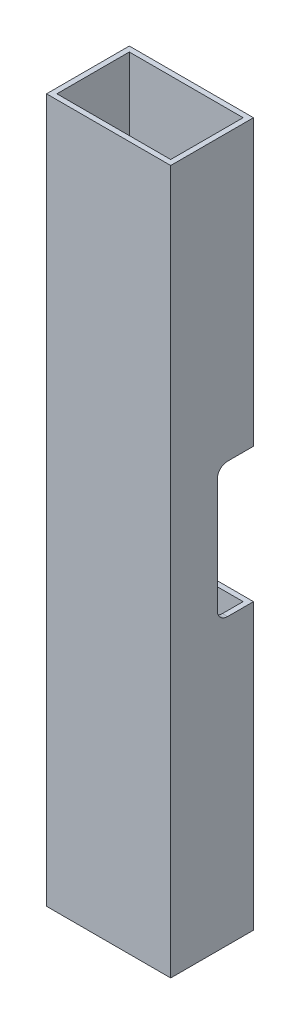
ISO-10303-21;
HEADER;
FILE_DESCRIPTION(('STEP AP214'),'2;1');
FILE_NAME('part.step','',(''),(''),'','','');
FILE_SCHEMA(('AUTOMOTIVE_DESIGN { 1 0 10303 214 1 1 1 1 }'));
ENDSEC;
DATA;
#1=APPLICATION_CONTEXT('core data for automotive mechanical design processes');
#2=APPLICATION_PROTOCOL_DEFINITION('international standard','automotive_design',2000,#1);
#3=PRODUCT_CONTEXT('',#1,'mechanical');
#4=PRODUCT('Part','Part','',(#3));
#5=PRODUCT_RELATED_PRODUCT_CATEGORY('part','',(#4));
#6=PRODUCT_DEFINITION_FORMATION('','',#4);
#7=PRODUCT_DEFINITION_CONTEXT('part definition',#1,'design');
#8=PRODUCT_DEFINITION('design','',#6,#7);
#9=PRODUCT_DEFINITION_SHAPE('','',#8);
#10=(LENGTH_UNIT() NAMED_UNIT(*) SI_UNIT(.MILLI.,.METRE.));
#11=(NAMED_UNIT(*) PLANE_ANGLE_UNIT() SI_UNIT($,.RADIAN.));
#12=(NAMED_UNIT(*) SI_UNIT($,.STERADIAN.) SOLID_ANGLE_UNIT());
#13=UNCERTAINTY_MEASURE_WITH_UNIT(LENGTH_MEASURE(1.E-05),#10,'distance_accuracy_value','');
#14=(GEOMETRIC_REPRESENTATION_CONTEXT(3) GLOBAL_UNCERTAINTY_ASSIGNED_CONTEXT((#13)) GLOBAL_UNIT_ASSIGNED_CONTEXT((#10,
#11,#12)) REPRESENTATION_CONTEXT('',''));
#15=CARTESIAN_POINT('',(0.,0.,0.));
#16=DIRECTION('',(0.,0.,1.));
#17=DIRECTION('',(1.,0.,0.));
#18=AXIS2_PLACEMENT_3D('',#15,#16,#17);
#19=CARTESIAN_POINT('',(0.,-215.9,-25.4));
#20=DIRECTION('',(0.,0.,-1.));
#21=DIRECTION('',(-1.,0.,0.));
#22=AXIS2_PLACEMENT_3D('',#19,#20,#21);
#23=PLANE('',#22);
#24=DIRECTION('',(0.,1.,0.));
#25=VECTOR('',#24,1.);
#26=CARTESIAN_POINT('',(38.1,-215.9,-25.4));
#27=LINE('',#26,#25);
#28=CARTESIAN_POINT('',(38.1,41.275,-25.4));
#29=VERTEX_POINT('',#28);
#30=CARTESIAN_POINT('',(38.1,215.9,-25.4));
#31=VERTEX_POINT('',#30);
#32=EDGE_CURVE('E215',#29,#31,#27,.T.);
#33=ORIENTED_EDGE('',*,*,#32,.F.);
#34=DIRECTION('',(-1.,0.,0.));
#35=VECTOR('',#34,1.);
#36=CARTESIAN_POINT('',(1971.59584113364,41.275,-25.3999999999995));
#37=LINE('',#36,#35);
#38=CARTESIAN_POINT('',(-38.1,41.275,-25.4));
#39=VERTEX_POINT('',#38);
#40=EDGE_CURVE('E202',#29,#39,#37,.T.);
#41=ORIENTED_EDGE('',*,*,#40,.T.);
#42=DIRECTION('',(0.,1.,0.));
#43=VECTOR('',#42,1.);
#44=CARTESIAN_POINT('',(-38.1,-215.9,-25.4));
#45=LINE('',#44,#43);
#46=CARTESIAN_POINT('',(-38.1,215.9,-25.4));
#47=VERTEX_POINT('',#46);
#48=EDGE_CURVE('E213',#39,#47,#45,.T.);
#49=ORIENTED_EDGE('',*,*,#48,.T.);
#50=DIRECTION('',(-1.,0.,0.));
#51=VECTOR('',#50,1.);
#52=CARTESIAN_POINT('',(0.,215.9,-25.4));
#53=LINE('',#52,#51);
#54=EDGE_CURVE('E329',#31,#47,#53,.T.);
#55=ORIENTED_EDGE('',*,*,#54,.F.);
#56=EDGE_LOOP('',(#33,#41,#49,#55));
#57=FACE_BOUND('',#56,.T.);
#58=ADVANCED_FACE('F16',(#57),#23,.T.);
#59=CARTESIAN_POINT('',(34.925,-215.9,0.));
#60=DIRECTION('',(1.,0.,0.));
#61=DIRECTION('',(0.,0.,-1.));
#62=AXIS2_PLACEMENT_3D('',#59,#60,#61);
#63=PLANE('',#62);
#64=DIRECTION('',(0.,0.,-1.));
#65=VECTOR('',#64,1.);
#66=CARTESIAN_POINT('',(34.925,41.275,-1.29116165991135E-13));
#67=LINE('',#66,#65);
#68=CARTESIAN_POINT('',(34.925,41.275,-9.525));
#69=VERTEX_POINT('',#68);
#70=CARTESIAN_POINT('',(34.925,41.275,-22.225));
#71=VERTEX_POINT('',#70);
#72=EDGE_CURVE('E700',#69,#71,#67,.T.);
#73=ORIENTED_EDGE('',*,*,#72,.F.);
#74=CARTESIAN_POINT('',(34.925,34.925,-9.525));
#75=DIRECTION('',(1.,0.,0.));
#76=DIRECTION('',(0.,0.,-1.));
#77=AXIS2_PLACEMENT_3D('',#74,#75,#76);
#78=CIRCLE('',#77,6.35);
#79=CARTESIAN_POINT('',(34.925,34.925,-3.175));
#80=VERTEX_POINT('',#79);
#81=EDGE_CURVE('E595',#69,#80,#78,.T.);
#82=ORIENTED_EDGE('',*,*,#81,.T.);
#83=DIRECTION('',(0.,-1.,0.));
#84=VECTOR('',#83,1.);
#85=CARTESIAN_POINT('',(34.925,-215.9,-3.17499999999996));
#86=LINE('',#85,#84);
#87=CARTESIAN_POINT('',(34.925,-34.925,-3.175));
#88=VERTEX_POINT('',#87);
#89=EDGE_CURVE('E590',#80,#88,#86,.T.);
#90=ORIENTED_EDGE('',*,*,#89,.T.);
#91=CARTESIAN_POINT('',(34.925,-34.925,-9.525));
#92=DIRECTION('',(1.,0.,0.));
#93=DIRECTION('',(0.,0.,-1.));
#94=AXIS2_PLACEMENT_3D('',#91,#92,#93);
#95=CIRCLE('',#94,6.35);
#96=CARTESIAN_POINT('',(34.925,-41.275,-9.525));
#97=VERTEX_POINT('',#96);
#98=EDGE_CURVE('E281',#88,#97,#95,.T.);
#99=ORIENTED_EDGE('',*,*,#98,.T.);
#100=DIRECTION('',(0.,0.,-1.));
#101=VECTOR('',#100,1.);
#102=CARTESIAN_POINT('',(34.925,-41.275,0.));
#103=LINE('',#102,#101);
#104=CARTESIAN_POINT('',(34.925,-41.275,-22.225));
#105=VERTEX_POINT('',#104);
#106=EDGE_CURVE('E280',#97,#105,#103,.T.);
#107=ORIENTED_EDGE('',*,*,#106,.T.);
#108=DIRECTION('',(0.,1.,0.));
#109=VECTOR('',#108,1.);
#110=CARTESIAN_POINT('',(34.925,-215.9,-22.225));
#111=LINE('',#110,#109);
#112=CARTESIAN_POINT('',(34.925,-215.9,-22.225));
#113=VERTEX_POINT('',#112);
#114=EDGE_CURVE('E278',#113,#105,#111,.T.);
#115=ORIENTED_EDGE('',*,*,#114,.F.);
#116=DIRECTION('',(0.,0.,-1.));
#117=VECTOR('',#116,1.);
#118=CARTESIAN_POINT('',(34.925,-215.9,0.));
#119=LINE('',#118,#117);
#120=CARTESIAN_POINT('',(34.925,-215.9,22.225));
#121=VERTEX_POINT('',#120);
#122=EDGE_CURVE('E311',#121,#113,#119,.T.);
#123=ORIENTED_EDGE('',*,*,#122,.F.);
#124=DIRECTION('',(0.,1.,0.));
#125=VECTOR('',#124,1.);
#126=CARTESIAN_POINT('',(34.925,-215.9,22.225));
#127=LINE('',#126,#125);
#128=CARTESIAN_POINT('',(34.925,215.9,22.225));
#129=VERTEX_POINT('',#128);
#130=EDGE_CURVE('E250',#121,#129,#127,.T.);
#131=ORIENTED_EDGE('',*,*,#130,.T.);
#132=DIRECTION('',(0.,0.,-1.));
#133=VECTOR('',#132,1.);
#134=CARTESIAN_POINT('',(34.925,215.9,0.));
#135=LINE('',#134,#133);
#136=CARTESIAN_POINT('',(34.925,215.9,-22.225));
#137=VERTEX_POINT('',#136);
#138=EDGE_CURVE('E309',#129,#137,#135,.T.);
#139=ORIENTED_EDGE('',*,*,#138,.T.);
#140=EDGE_CURVE('E288',#71,#137,#111,.T.);
#141=ORIENTED_EDGE('',*,*,#140,.F.);
#142=EDGE_LOOP('',(#73,#82,#90,#99,#107,#115,#123,#131,#139,#141));
#143=FACE_BOUND('',#142,.T.);
#144=ADVANCED_FACE('F307',(#143),#63,.F.);
#145=CARTESIAN_POINT('',(0.,-215.9,-22.225));
#146=DIRECTION('',(0.,0.,-1.));
#147=DIRECTION('',(-1.,0.,0.));
#148=AXIS2_PLACEMENT_3D('',#145,#146,#147);
#149=PLANE('',#148);
#150=DIRECTION('',(-1.,0.,0.));
#151=VECTOR('',#150,1.);
#152=CARTESIAN_POINT('',(0.,41.275,-22.225));
#153=LINE('',#152,#151);
#154=CARTESIAN_POINT('',(-34.925,41.275,-22.225));
#155=VERTEX_POINT('',#154);
#156=EDGE_CURVE('E692',#71,#155,#153,.T.);
#157=ORIENTED_EDGE('',*,*,#156,.F.);
#158=ORIENTED_EDGE('',*,*,#140,.T.);
#159=DIRECTION('',(-1.,0.,0.));
#160=VECTOR('',#159,1.);
#161=CARTESIAN_POINT('',(0.,215.9,-22.225));
#162=LINE('',#161,#160);
#163=CARTESIAN_POINT('',(-34.925,215.9,-22.225));
#164=VERTEX_POINT('',#163);
#165=EDGE_CURVE('E324',#137,#164,#162,.T.);
#166=ORIENTED_EDGE('',*,*,#165,.T.);
#167=DIRECTION('',(0.,1.,0.));
#168=VECTOR('',#167,1.);
#169=CARTESIAN_POINT('',(-34.925,-215.9,-22.225));
#170=LINE('',#169,#168);
#171=EDGE_CURVE('E289',#155,#164,#170,.T.);
#172=ORIENTED_EDGE('',*,*,#171,.F.);
#173=EDGE_LOOP('',(#157,#158,#166,#172));
#174=FACE_BOUND('',#173,.T.);
#175=ADVANCED_FACE('F482',(#174),#149,.F.);
#176=CARTESIAN_POINT('',(38.1,-215.9,0.));
#177=DIRECTION('',(1.,0.,0.));
#178=DIRECTION('',(0.,0.,-1.));
#179=AXIS2_PLACEMENT_3D('',#176,#177,#178);
#180=PLANE('',#179);
#181=CARTESIAN_POINT('',(38.1,34.925,-9.525));
#182=DIRECTION('',(1.,0.,0.));
#183=DIRECTION('',(0.,0.,-1.));
#184=AXIS2_PLACEMENT_3D('',#181,#182,#183);
#185=CIRCLE('',#184,6.35);
#186=CARTESIAN_POINT('',(38.1,41.275,-9.525));
#187=VERTEX_POINT('',#186);
#188=CARTESIAN_POINT('',(38.1,34.925,-3.175));
#189=VERTEX_POINT('',#188);
#190=EDGE_CURVE('E217',#187,#189,#185,.T.);
#191=ORIENTED_EDGE('',*,*,#190,.F.);
#192=DIRECTION('',(0.,0.,-1.));
#193=VECTOR('',#192,1.);
#194=CARTESIAN_POINT('',(38.1,41.275,-1.29116165991135E-13));
#195=LINE('',#194,#193);
#196=EDGE_CURVE('E357',#187,#29,#195,.T.);
#197=ORIENTED_EDGE('',*,*,#196,.T.);
#198=ORIENTED_EDGE('',*,*,#32,.T.);
#199=DIRECTION('',(0.,0.,-1.));
#200=VECTOR('',#199,1.);
#201=CARTESIAN_POINT('',(38.1,215.9,0.));
#202=LINE('',#201,#200);
#203=CARTESIAN_POINT('',(38.1,215.9,25.4));
#204=VERTEX_POINT('',#203);
#205=EDGE_CURVE('E376',#204,#31,#202,.T.);
#206=ORIENTED_EDGE('',*,*,#205,.F.);
#207=DIRECTION('',(0.,1.,0.));
#208=VECTOR('',#207,1.);
#209=CARTESIAN_POINT('',(38.1,-215.9,25.4));
#210=LINE('',#209,#208);
#211=CARTESIAN_POINT('',(38.1,-215.9,25.4));
#212=VERTEX_POINT('',#211);
#213=EDGE_CURVE('E242',#212,#204,#210,.T.);
#214=ORIENTED_EDGE('',*,*,#213,.F.);
#215=DIRECTION('',(0.,0.,-1.));
#216=VECTOR('',#215,1.);
#217=CARTESIAN_POINT('',(38.1,-215.9,0.));
#218=LINE('',#217,#216);
#219=CARTESIAN_POINT('',(38.1,-215.9,-25.4));
#220=VERTEX_POINT('',#219);
#221=EDGE_CURVE('E342',#212,#220,#218,.T.);
#222=ORIENTED_EDGE('',*,*,#221,.T.);
#223=CARTESIAN_POINT('',(38.1,-41.275,-25.4));
#224=VERTEX_POINT('',#223);
#225=EDGE_CURVE('E227',#220,#224,#27,.T.);
#226=ORIENTED_EDGE('',*,*,#225,.T.);
#227=DIRECTION('',(0.,0.,-1.));
#228=VECTOR('',#227,1.);
#229=CARTESIAN_POINT('',(38.1,-41.275,0.));
#230=LINE('',#229,#228);
#231=CARTESIAN_POINT('',(38.1,-41.275,-9.525));
#232=VERTEX_POINT('',#231);
#233=EDGE_CURVE('E689',#232,#224,#230,.T.);
#234=ORIENTED_EDGE('',*,*,#233,.F.);
#235=CARTESIAN_POINT('',(38.1,-34.925,-9.525));
#236=DIRECTION('',(1.,0.,0.));
#237=DIRECTION('',(0.,0.,-1.));
#238=AXIS2_PLACEMENT_3D('',#235,#236,#237);
#239=CIRCLE('',#238,6.35);
#240=CARTESIAN_POINT('',(38.1,-34.925,-3.175));
#241=VERTEX_POINT('',#240);
#242=EDGE_CURVE('E586',#241,#232,#239,.T.);
#243=ORIENTED_EDGE('',*,*,#242,.F.);
#244=DIRECTION('',(0.,-1.,0.));
#245=VECTOR('',#244,1.);
#246=CARTESIAN_POINT('',(38.1,-215.9,-3.17499999999995));
#247=LINE('',#246,#245);
#248=EDGE_CURVE('E598',#189,#241,#247,.T.);
#249=ORIENTED_EDGE('',*,*,#248,.F.);
#250=EDGE_LOOP('',(#191,#197,#198,#206,#214,#222,#226,#234,#243,#249));
#251=FACE_BOUND('',#250,.T.);
#252=ADVANCED_FACE('F18',(#251),#180,.T.);
#253=CARTESIAN_POINT('',(-34.925,-215.9,0.));
#254=DIRECTION('',(1.,0.,0.));
#255=DIRECTION('',(0.,0.,-1.));
#256=AXIS2_PLACEMENT_3D('',#253,#254,#255);
#257=PLANE('',#256);
#258=CARTESIAN_POINT('',(-34.925,34.925,-9.525));
#259=DIRECTION('',(1.,0.,0.));
#260=DIRECTION('',(0.,0.,-1.));
#261=AXIS2_PLACEMENT_3D('',#258,#259,#260);
#262=CIRCLE('',#261,6.35);
#263=CARTESIAN_POINT('',(-34.925,41.275,-9.52499999999974));
#264=VERTEX_POINT('',#263);
#265=CARTESIAN_POINT('',(-34.925,34.925,-3.175));
#266=VERTEX_POINT('',#265);
#267=EDGE_CURVE('E246',#264,#266,#262,.T.);
#268=ORIENTED_EDGE('',*,*,#267,.F.);
#269=DIRECTION('',(0.,0.,-1.));
#270=VECTOR('',#269,1.);
#271=CARTESIAN_POINT('',(-34.925,41.275,-1.29116165991135E-13));
#272=LINE('',#271,#270);
#273=EDGE_CURVE('E11',#264,#155,#272,.T.);
#274=ORIENTED_EDGE('',*,*,#273,.T.);
#275=ORIENTED_EDGE('',*,*,#171,.T.);
#276=DIRECTION('',(0.,0.,-1.));
#277=VECTOR('',#276,1.);
#278=CARTESIAN_POINT('',(-34.925,215.9,0.));
#279=LINE('',#278,#277);
#280=CARTESIAN_POINT('',(-34.925,215.9,22.225));
#281=VERTEX_POINT('',#280);
#282=EDGE_CURVE('E340',#281,#164,#279,.T.);
#283=ORIENTED_EDGE('',*,*,#282,.F.);
#284=DIRECTION('',(0.,1.,0.));
#285=VECTOR('',#284,1.);
#286=CARTESIAN_POINT('',(-34.925,-215.9,22.225));
#287=LINE('',#286,#285);
#288=CARTESIAN_POINT('',(-34.925,-215.9,22.225));
#289=VERTEX_POINT('',#288);
#290=EDGE_CURVE('E245',#289,#281,#287,.T.);
#291=ORIENTED_EDGE('',*,*,#290,.F.);
#292=DIRECTION('',(0.,0.,-1.));
#293=VECTOR('',#292,1.);
#294=CARTESIAN_POINT('',(-34.925,-215.9,0.));
#295=LINE('',#294,#293);
#296=CARTESIAN_POINT('',(-34.925,-215.9,-22.225));
#297=VERTEX_POINT('',#296);
#298=EDGE_CURVE('E286',#289,#297,#295,.T.);
#299=ORIENTED_EDGE('',*,*,#298,.T.);
#300=CARTESIAN_POINT('',(-34.925,-41.275,-22.225));
#301=VERTEX_POINT('',#300);
#302=EDGE_CURVE('E275',#297,#301,#170,.T.);
#303=ORIENTED_EDGE('',*,*,#302,.T.);
#304=DIRECTION('',(0.,0.,-1.));
#305=VECTOR('',#304,1.);
#306=CARTESIAN_POINT('',(-34.925,-41.275,0.));
#307=LINE('',#306,#305);
#308=CARTESIAN_POINT('',(-34.925,-41.275,-9.525));
#309=VERTEX_POINT('',#308);
#310=EDGE_CURVE('E25',#309,#301,#307,.T.);
#311=ORIENTED_EDGE('',*,*,#310,.F.);
#312=CARTESIAN_POINT('',(-34.925,-34.925,-9.525));
#313=DIRECTION('',(1.,0.,0.));
#314=DIRECTION('',(0.,0.,-1.));
#315=AXIS2_PLACEMENT_3D('',#312,#313,#314);
#316=CIRCLE('',#315,6.35);
#317=CARTESIAN_POINT('',(-34.925,-34.925,-3.175));
#318=VERTEX_POINT('',#317);
#319=EDGE_CURVE('E253',#318,#309,#316,.T.);
#320=ORIENTED_EDGE('',*,*,#319,.F.);
#321=DIRECTION('',(0.,-1.,0.));
#322=VECTOR('',#321,1.);
#323=CARTESIAN_POINT('',(-34.925,-215.9,-3.175));
#324=LINE('',#323,#322);
#325=EDGE_CURVE('E249',#266,#318,#324,.T.);
#326=ORIENTED_EDGE('',*,*,#325,.F.);
#327=EDGE_LOOP('',(#268,#274,#275,#283,#291,#299,#303,#311,#320,#326));
#328=FACE_BOUND('',#327,.T.);
#329=ADVANCED_FACE('F284',(#328),#257,.T.);
#330=CARTESIAN_POINT('',(0.,-215.9,22.225));
#331=DIRECTION('',(0.,0.,-1.));
#332=DIRECTION('',(-1.,0.,0.));
#333=AXIS2_PLACEMENT_3D('',#330,#331,#332);
#334=PLANE('',#333);
#335=DIRECTION('',(-1.,0.,0.));
#336=VECTOR('',#335,1.);
#337=CARTESIAN_POINT('',(0.,215.9,22.225));
#338=LINE('',#337,#336);
#339=EDGE_CURVE('E321',#129,#281,#338,.T.);
#340=ORIENTED_EDGE('',*,*,#339,.F.);
#341=ORIENTED_EDGE('',*,*,#130,.F.);
#342=DIRECTION('',(-1.,0.,0.));
#343=VECTOR('',#342,1.);
#344=CARTESIAN_POINT('',(0.,-215.9,22.225));
#345=LINE('',#344,#343);
#346=EDGE_CURVE('E366',#121,#289,#345,.T.);
#347=ORIENTED_EDGE('',*,*,#346,.T.);
#348=ORIENTED_EDGE('',*,*,#290,.T.);
#349=EDGE_LOOP('',(#340,#341,#347,#348));
#350=FACE_BOUND('',#349,.T.);
#351=ADVANCED_FACE('F327',(#350),#334,.T.);
#352=ORIENTED_EDGE('',*,*,#114,.T.);
#353=DIRECTION('',(-1.,0.,0.));
#354=VECTOR('',#353,1.);
#355=CARTESIAN_POINT('',(0.,-41.275,-22.225));
#356=LINE('',#355,#354);
#357=EDGE_CURVE('E264',#105,#301,#356,.T.);
#358=ORIENTED_EDGE('',*,*,#357,.T.);
#359=ORIENTED_EDGE('',*,*,#302,.F.);
#360=DIRECTION('',(-1.,0.,0.));
#361=VECTOR('',#360,1.);
#362=CARTESIAN_POINT('',(0.,-215.9,-22.225));
#363=LINE('',#362,#361);
#364=EDGE_CURVE('E371',#113,#297,#363,.T.);
#365=ORIENTED_EDGE('',*,*,#364,.F.);
#366=EDGE_LOOP('',(#352,#358,#359,#365));
#367=FACE_BOUND('',#366,.T.);
#368=ADVANCED_FACE('F274',(#367),#149,.F.);
#369=CARTESIAN_POINT('',(0.,-215.9,25.4));
#370=DIRECTION('',(0.,0.,-1.));
#371=DIRECTION('',(-1.,0.,0.));
#372=AXIS2_PLACEMENT_3D('',#369,#370,#371);
#373=PLANE('',#372);
#374=DIRECTION('',(-1.,0.,0.));
#375=VECTOR('',#374,1.);
#376=CARTESIAN_POINT('',(0.,215.9,25.4));
#377=LINE('',#376,#375);
#378=CARTESIAN_POINT('',(-38.1,215.9,25.4));
#379=VERTEX_POINT('',#378);
#380=EDGE_CURVE('E380',#204,#379,#377,.T.);
#381=ORIENTED_EDGE('',*,*,#380,.T.);
#382=DIRECTION('',(0.,1.,0.));
#383=VECTOR('',#382,1.);
#384=CARTESIAN_POINT('',(-38.1,-215.9,25.4));
#385=LINE('',#384,#383);
#386=CARTESIAN_POINT('',(-38.1,-215.9,25.4));
#387=VERTEX_POINT('',#386);
#388=EDGE_CURVE('E234',#387,#379,#385,.T.);
#389=ORIENTED_EDGE('',*,*,#388,.F.);
#390=DIRECTION('',(-1.,0.,0.));
#391=VECTOR('',#390,1.);
#392=CARTESIAN_POINT('',(0.,-215.9,25.4));
#393=LINE('',#392,#391);
#394=EDGE_CURVE('E347',#212,#387,#393,.T.);
#395=ORIENTED_EDGE('',*,*,#394,.F.);
#396=ORIENTED_EDGE('',*,*,#213,.T.);
#397=EDGE_LOOP('',(#381,#389,#395,#396));
#398=FACE_BOUND('',#397,.T.);
#399=ADVANCED_FACE('F497',(#398),#373,.F.);
#400=CARTESIAN_POINT('',(-38.1,-215.9,0.));
#401=DIRECTION('',(1.,0.,0.));
#402=DIRECTION('',(0.,0.,-1.));
#403=AXIS2_PLACEMENT_3D('',#400,#401,#402);
#404=PLANE('',#403);
#405=ORIENTED_EDGE('',*,*,#48,.F.);
#406=DIRECTION('',(0.,0.,1.));
#407=VECTOR('',#406,1.);
#408=CARTESIAN_POINT('',(-38.1,41.275,-16.5904098328203));
#409=LINE('',#408,#407);
#410=CARTESIAN_POINT('',(-38.1,41.275,-9.525));
#411=VERTEX_POINT('',#410);
#412=EDGE_CURVE('E198',#39,#411,#409,.T.);
#413=ORIENTED_EDGE('',*,*,#412,.T.);
#414=CARTESIAN_POINT('',(-38.1,34.925,-9.525));
#415=DIRECTION('',(-1.,0.,0.));
#416=DIRECTION('',(0.,0.,1.));
#417=AXIS2_PLACEMENT_3D('',#414,#415,#416);
#418=CIRCLE('',#417,6.35);
#419=CARTESIAN_POINT('',(-38.1,34.925,-3.175));
#420=VERTEX_POINT('',#419);
#421=EDGE_CURVE('E455',#420,#411,#418,.T.);
#422=ORIENTED_EDGE('',*,*,#421,.F.);
#423=DIRECTION('',(0.,1.,0.));
#424=VECTOR('',#423,1.);
#425=CARTESIAN_POINT('',(-38.1,-0.325113534927367,-3.175));
#426=LINE('',#425,#424);
#427=CARTESIAN_POINT('',(-38.1,-34.925,-3.175));
#428=VERTEX_POINT('',#427);
#429=EDGE_CURVE('E36',#428,#420,#426,.T.);
#430=ORIENTED_EDGE('',*,*,#429,.F.);
#431=CARTESIAN_POINT('',(-38.1,-34.925,-9.525));
#432=DIRECTION('',(-1.,0.,0.));
#433=DIRECTION('',(0.,-1.,0.));
#434=AXIS2_PLACEMENT_3D('',#431,#432,#433);
#435=CIRCLE('',#434,6.35);
#436=CARTESIAN_POINT('',(-38.1,-41.275,-9.525));
#437=VERTEX_POINT('',#436);
#438=EDGE_CURVE('E631',#437,#428,#435,.T.);
#439=ORIENTED_EDGE('',*,*,#438,.F.);
#440=DIRECTION('',(0.,0.,1.));
#441=VECTOR('',#440,1.);
#442=CARTESIAN_POINT('',(-38.1,-41.275,-16.5904098328203));
#443=LINE('',#442,#441);
#444=CARTESIAN_POINT('',(-38.1,-41.275,-25.4));
#445=VERTEX_POINT('',#444);
#446=EDGE_CURVE('E208',#445,#437,#443,.T.);
#447=ORIENTED_EDGE('',*,*,#446,.F.);
#448=CARTESIAN_POINT('',(-38.1,-215.9,-25.4));
#449=VERTEX_POINT('',#448);
#450=EDGE_CURVE('E226',#449,#445,#45,.T.);
#451=ORIENTED_EDGE('',*,*,#450,.F.);
#452=DIRECTION('',(0.,0.,-1.));
#453=VECTOR('',#452,1.);
#454=CARTESIAN_POINT('',(-38.1,-215.9,0.));
#455=LINE('',#454,#453);
#456=EDGE_CURVE('E354',#387,#449,#455,.T.);
#457=ORIENTED_EDGE('',*,*,#456,.F.);
#458=ORIENTED_EDGE('',*,*,#388,.T.);
#459=DIRECTION('',(0.,0.,-1.));
#460=VECTOR('',#459,1.);
#461=CARTESIAN_POINT('',(-38.1,215.9,0.));
#462=LINE('',#461,#460);
#463=EDGE_CURVE('E223',#379,#47,#462,.T.);
#464=ORIENTED_EDGE('',*,*,#463,.T.);
#465=EDGE_LOOP('',(#405,#413,#422,#430,#439,#447,#451,#457,#458,#464));
#466=FACE_BOUND('',#465,.T.);
#467=ADVANCED_FACE('F220',(#466),#404,.F.);
#468=DIRECTION('',(-1.,0.,0.));
#469=VECTOR('',#468,1.);
#470=CARTESIAN_POINT('',(1971.59584113364,-41.275,-25.3999999999995));
#471=LINE('',#470,#469);
#472=EDGE_CURVE('E218',#224,#445,#471,.T.);
#473=ORIENTED_EDGE('',*,*,#472,.F.);
#474=ORIENTED_EDGE('',*,*,#225,.F.);
#475=DIRECTION('',(-1.,0.,0.));
#476=VECTOR('',#475,1.);
#477=CARTESIAN_POINT('',(0.,-215.9,-25.4));
#478=LINE('',#477,#476);
#479=EDGE_CURVE('E362',#220,#449,#478,.T.);
#480=ORIENTED_EDGE('',*,*,#479,.T.);
#481=ORIENTED_EDGE('',*,*,#450,.T.);
#482=EDGE_LOOP('',(#473,#474,#480,#481));
#483=FACE_BOUND('',#482,.T.);
#484=ADVANCED_FACE('F465',(#483),#23,.T.);
#485=CARTESIAN_POINT('',(0.,-215.9,0.));
#486=DIRECTION('',(0.,-1.,0.));
#487=DIRECTION('',(1.,0.,0.));
#488=AXIS2_PLACEMENT_3D('',#485,#486,#487);
#489=PLANE('',#488);
#490=ORIENTED_EDGE('',*,*,#221,.F.);
#491=ORIENTED_EDGE('',*,*,#394,.T.);
#492=ORIENTED_EDGE('',*,*,#456,.T.);
#493=ORIENTED_EDGE('',*,*,#479,.F.);
#494=EDGE_LOOP('',(#490,#491,#492,#493));
#495=FACE_BOUND('',#494,.T.);
#496=ORIENTED_EDGE('',*,*,#346,.F.);
#497=ORIENTED_EDGE('',*,*,#122,.T.);
#498=ORIENTED_EDGE('',*,*,#364,.T.);
#499=ORIENTED_EDGE('',*,*,#298,.F.);
#500=EDGE_LOOP('',(#496,#497,#498,#499));
#501=FACE_BOUND('',#500,.T.);
#502=ADVANCED_FACE('F475',(#495,#501),#489,.T.);
#503=CARTESIAN_POINT('',(0.,215.9,0.));
#504=DIRECTION('',(0.,-1.,0.));
#505=DIRECTION('',(1.,0.,0.));
#506=AXIS2_PLACEMENT_3D('',#503,#504,#505);
#507=PLANE('',#506);
#508=ORIENTED_EDGE('',*,*,#205,.T.);
#509=ORIENTED_EDGE('',*,*,#54,.T.);
#510=ORIENTED_EDGE('',*,*,#463,.F.);
#511=ORIENTED_EDGE('',*,*,#380,.F.);
#512=EDGE_LOOP('',(#508,#509,#510,#511));
#513=FACE_BOUND('',#512,.T.);
#514=ORIENTED_EDGE('',*,*,#339,.T.);
#515=ORIENTED_EDGE('',*,*,#282,.T.);
#516=ORIENTED_EDGE('',*,*,#165,.F.);
#517=ORIENTED_EDGE('',*,*,#138,.F.);
#518=EDGE_LOOP('',(#514,#515,#516,#517));
#519=FACE_BOUND('',#518,.T.);
#520=ADVANCED_FACE('F319',(#513,#519),#507,.F.);
#521=CARTESIAN_POINT('',(1971.59584113364,41.275,-16.5904098328198));
#522=DIRECTION('',(0.,-1.,0.));
#523=DIRECTION('',(0.,0.,-1.));
#524=AXIS2_PLACEMENT_3D('',#521,#522,#523);
#525=PLANE('',#524);
#526=DIRECTION('',(-1.,0.,0.));
#527=VECTOR('',#526,1.);
#528=CARTESIAN_POINT('',(1971.59584113364,41.275,-9.52499999999946));
#529=LINE('',#528,#527);
#530=EDGE_CURVE('E434',#187,#69,#529,.T.);
#531=ORIENTED_EDGE('',*,*,#530,.T.);
#532=ORIENTED_EDGE('',*,*,#72,.T.);
#533=ORIENTED_EDGE('',*,*,#156,.T.);
#534=ORIENTED_EDGE('',*,*,#273,.F.);
#535=EDGE_CURVE('E48',#264,#411,#529,.T.);
#536=ORIENTED_EDGE('',*,*,#535,.T.);
#537=ORIENTED_EDGE('',*,*,#412,.F.);
#538=ORIENTED_EDGE('',*,*,#40,.F.);
#539=ORIENTED_EDGE('',*,*,#196,.F.);
#540=EDGE_LOOP('',(#531,#532,#533,#534,#536,#537,#538,#539));
#541=FACE_BOUND('',#540,.T.);
#542=ADVANCED_FACE('F201',(#541),#525,.T.);
#543=CARTESIAN_POINT('',(1971.59584113364,-41.275,-16.5904098328198));
#544=DIRECTION('',(0.,-1.,0.));
#545=DIRECTION('',(0.,0.,-1.));
#546=AXIS2_PLACEMENT_3D('',#543,#544,#545);
#547=PLANE('',#546);
#548=ORIENTED_EDGE('',*,*,#233,.T.);
#549=ORIENTED_EDGE('',*,*,#472,.T.);
#550=ORIENTED_EDGE('',*,*,#446,.T.);
#551=DIRECTION('',(-1.,0.,0.));
#552=VECTOR('',#551,1.);
#553=CARTESIAN_POINT('',(1971.59584113364,-41.275,-9.52499999999945));
#554=LINE('',#553,#552);
#555=EDGE_CURVE('E267',#309,#437,#554,.T.);
#556=ORIENTED_EDGE('',*,*,#555,.F.);
#557=ORIENTED_EDGE('',*,*,#310,.T.);
#558=ORIENTED_EDGE('',*,*,#357,.F.);
#559=ORIENTED_EDGE('',*,*,#106,.F.);
#560=EDGE_CURVE('E445',#232,#97,#554,.T.);
#561=ORIENTED_EDGE('',*,*,#560,.F.);
#562=EDGE_LOOP('',(#548,#549,#550,#556,#557,#558,#559,#561));
#563=FACE_BOUND('',#562,.T.);
#564=ADVANCED_FACE('F263',(#563),#547,.F.);
#565=CARTESIAN_POINT('',(1971.59584113364,-34.925,-9.52499999999946));
#566=DIRECTION('',(-1.,0.,0.));
#567=DIRECTION('',(0.,0.,1.));
#568=AXIS2_PLACEMENT_3D('',#565,#566,#567);
#569=CYLINDRICAL_SURFACE('',#568,6.35);
#570=DIRECTION('',(-1.,0.,0.));
#571=VECTOR('',#570,1.);
#572=CARTESIAN_POINT('',(1971.59584113364,-34.925,-3.17499999999945));
#573=LINE('',#572,#571);
#574=EDGE_CURVE('E422',#241,#88,#573,.T.);
#575=ORIENTED_EDGE('',*,*,#574,.F.);
#576=ORIENTED_EDGE('',*,*,#242,.T.);
#577=ORIENTED_EDGE('',*,*,#560,.T.);
#578=ORIENTED_EDGE('',*,*,#98,.F.);
#579=EDGE_LOOP('',(#575,#576,#577,#578));
#580=FACE_BOUND('',#579,.T.);
#581=ADVANCED_FACE('F522',(#580),#569,.F.);
#582=CARTESIAN_POINT('',(1971.59584113364,-0.325113534927367,-3.17499999999945));
#583=DIRECTION('',(0.,0.,1.));
#584=DIRECTION('',(1.,0.,0.));
#585=AXIS2_PLACEMENT_3D('',#582,#583,#584);
#586=PLANE('',#585);
#587=DIRECTION('',(-1.,0.,0.));
#588=VECTOR('',#587,1.);
#589=CARTESIAN_POINT('',(1971.59584113364,34.925,-3.17499999999946));
#590=LINE('',#589,#588);
#591=EDGE_CURVE('E423',#189,#80,#590,.T.);
#592=ORIENTED_EDGE('',*,*,#591,.F.);
#593=ORIENTED_EDGE('',*,*,#248,.T.);
#594=ORIENTED_EDGE('',*,*,#574,.T.);
#595=ORIENTED_EDGE('',*,*,#89,.F.);
#596=EDGE_LOOP('',(#592,#593,#594,#595));
#597=FACE_BOUND('',#596,.T.);
#598=ADVANCED_FACE('F511',(#597),#586,.F.);
#599=CARTESIAN_POINT('',(1971.59584113364,34.925,-9.52499999999946));
#600=DIRECTION('',(-1.,0.,0.));
#601=DIRECTION('',(0.,0.,1.));
#602=AXIS2_PLACEMENT_3D('',#599,#600,#601);
#603=CYLINDRICAL_SURFACE('',#602,6.35);
#604=ORIENTED_EDGE('',*,*,#530,.F.);
#605=ORIENTED_EDGE('',*,*,#190,.T.);
#606=ORIENTED_EDGE('',*,*,#591,.T.);
#607=ORIENTED_EDGE('',*,*,#81,.F.);
#608=EDGE_LOOP('',(#604,#605,#606,#607));
#609=FACE_BOUND('',#608,.T.);
#610=ADVANCED_FACE('F521',(#609),#603,.F.);
#611=ORIENTED_EDGE('',*,*,#319,.T.);
#612=ORIENTED_EDGE('',*,*,#555,.T.);
#613=ORIENTED_EDGE('',*,*,#438,.T.);
#614=EDGE_CURVE('E418',#318,#428,#573,.T.);
#615=ORIENTED_EDGE('',*,*,#614,.F.);
#616=EDGE_LOOP('',(#611,#612,#613,#615));
#617=FACE_BOUND('',#616,.T.);
#618=ADVANCED_FACE('F509',(#617),#569,.F.);
#619=ORIENTED_EDGE('',*,*,#325,.T.);
#620=ORIENTED_EDGE('',*,*,#614,.T.);
#621=ORIENTED_EDGE('',*,*,#429,.T.);
#622=EDGE_CURVE('E430',#266,#420,#590,.T.);
#623=ORIENTED_EDGE('',*,*,#622,.F.);
#624=EDGE_LOOP('',(#619,#620,#621,#623));
#625=FACE_BOUND('',#624,.T.);
#626=ADVANCED_FACE('F503',(#625),#586,.F.);
#627=ORIENTED_EDGE('',*,*,#267,.T.);
#628=ORIENTED_EDGE('',*,*,#622,.T.);
#629=ORIENTED_EDGE('',*,*,#421,.T.);
#630=ORIENTED_EDGE('',*,*,#535,.F.);
#631=EDGE_LOOP('',(#627,#628,#629,#630));
#632=FACE_BOUND('',#631,.T.);
#633=ADVANCED_FACE('F508',(#632),#603,.F.);
#634=CLOSED_SHELL('',(#58,#144,#175,#252,#329,#351,#368,#399,#467,#484,#502,#520,#542,#564,#581,
#598,#610,#618,#626,#633));
#635=MANIFOLD_SOLID_BREP('B1',#634);
#636=ADVANCED_BREP_SHAPE_REPRESENTATION('',(#18,#635),#14);
#637=SHAPE_DEFINITION_REPRESENTATION(#9,#636);
ENDSEC;
END-ISO-10303-21;
